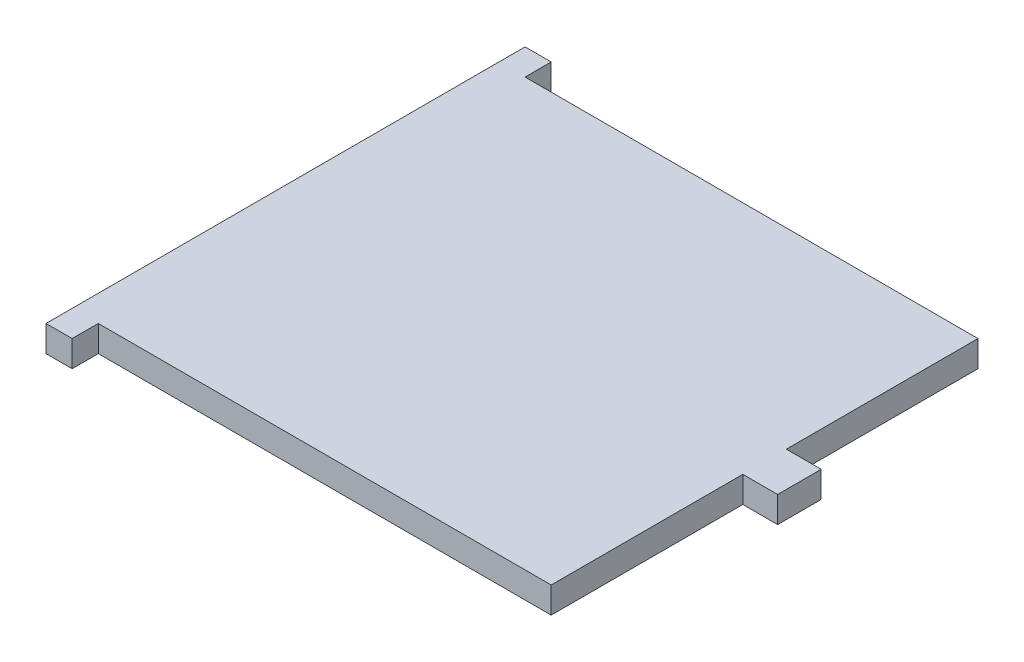
ISO-10303-21;
HEADER;
FILE_DESCRIPTION(('STEP AP214'),'2;1');
FILE_NAME('part.step','',(''),(''),'','','');
FILE_SCHEMA(('AUTOMOTIVE_DESIGN { 1 0 10303 214 1 1 1 1 }'));
ENDSEC;
DATA;
#1=APPLICATION_CONTEXT('core data for automotive mechanical design processes');
#2=APPLICATION_PROTOCOL_DEFINITION('international standard','automotive_design',2000,#1);
#3=PRODUCT_CONTEXT('',#1,'mechanical');
#4=PRODUCT('Part','Part','',(#3));
#5=PRODUCT_RELATED_PRODUCT_CATEGORY('part','',(#4));
#6=PRODUCT_DEFINITION_FORMATION('','',#4);
#7=PRODUCT_DEFINITION_CONTEXT('part definition',#1,'design');
#8=PRODUCT_DEFINITION('design','',#6,#7);
#9=PRODUCT_DEFINITION_SHAPE('','',#8);
#10=(LENGTH_UNIT() NAMED_UNIT(*) SI_UNIT(.MILLI.,.METRE.));
#11=(NAMED_UNIT(*) PLANE_ANGLE_UNIT() SI_UNIT($,.RADIAN.));
#12=(NAMED_UNIT(*) SI_UNIT($,.STERADIAN.) SOLID_ANGLE_UNIT());
#13=UNCERTAINTY_MEASURE_WITH_UNIT(LENGTH_MEASURE(1.E-05),#10,'distance_accuracy_value','');
#14=(GEOMETRIC_REPRESENTATION_CONTEXT(3) GLOBAL_UNCERTAINTY_ASSIGNED_CONTEXT((#13)) GLOBAL_UNIT_ASSIGNED_CONTEXT((#10,
#11,#12)) REPRESENTATION_CONTEXT('',''));
#15=CARTESIAN_POINT('',(0.,0.,0.));
#16=DIRECTION('',(0.,0.,1.));
#17=DIRECTION('',(1.,0.,0.));
#18=AXIS2_PLACEMENT_3D('',#15,#16,#17);
#19=CARTESIAN_POINT('',(0.,3.,24.5));
#20=DIRECTION('',(0.,0.,-1.));
#21=DIRECTION('',(-1.,0.,0.));
#22=AXIS2_PLACEMENT_3D('',#19,#20,#21);
#23=PLANE('',#22);
#24=DIRECTION('',(1.,0.,0.));
#25=VECTOR('',#24,1.);
#26=CARTESIAN_POINT('',(0.,0.,24.5));
#27=LINE('',#26,#25);
#28=CARTESIAN_POINT('',(-27.5,0.,24.5));
#29=VERTEX_POINT('',#28);
#30=CARTESIAN_POINT('',(24.5,0.,24.5));
#31=VERTEX_POINT('',#30);
#32=EDGE_CURVE('E159',#29,#31,#27,.T.);
#33=ORIENTED_EDGE('',*,*,#32,.T.);
#34=DIRECTION('',(0.,-1.,0.));
#35=VECTOR('',#34,1.);
#36=CARTESIAN_POINT('',(24.5,3.,24.5));
#37=LINE('',#36,#35);
#38=CARTESIAN_POINT('',(24.5,3.,24.5));
#39=VERTEX_POINT('',#38);
#40=EDGE_CURVE('E11',#39,#31,#37,.T.);
#41=ORIENTED_EDGE('',*,*,#40,.F.);
#42=DIRECTION('',(1.,0.,0.));
#43=VECTOR('',#42,1.);
#44=CARTESIAN_POINT('',(0.,3.,24.5));
#45=LINE('',#44,#43);
#46=CARTESIAN_POINT('',(-27.5,3.,24.5));
#47=VERTEX_POINT('',#46);
#48=EDGE_CURVE('E234',#47,#39,#45,.T.);
#49=ORIENTED_EDGE('',*,*,#48,.F.);
#50=DIRECTION('',(0.,-1.,0.));
#51=VECTOR('',#50,1.);
#52=CARTESIAN_POINT('',(-27.5,3.,24.5));
#53=LINE('',#52,#51);
#54=EDGE_CURVE('E53',#47,#29,#53,.T.);
#55=ORIENTED_EDGE('',*,*,#54,.T.);
#56=EDGE_LOOP('',(#33,#41,#49,#55));
#57=FACE_BOUND('',#56,.T.);
#58=ADVANCED_FACE('F37',(#57),#23,.F.);
#59=CARTESIAN_POINT('',(24.5,3.,0.));
#60=DIRECTION('',(-1.,0.,0.));
#61=DIRECTION('',(0.,0.,1.));
#62=AXIS2_PLACEMENT_3D('',#59,#60,#61);
#63=PLANE('',#62);
#64=DIRECTION('',(0.,0.,-1.));
#65=VECTOR('',#64,1.);
#66=CARTESIAN_POINT('',(24.5,0.,0.));
#67=LINE('',#66,#65);
#68=CARTESIAN_POINT('',(24.5,0.,2.5));
#69=VERTEX_POINT('',#68);
#70=EDGE_CURVE('E161',#31,#69,#67,.T.);
#71=ORIENTED_EDGE('',*,*,#70,.T.);
#72=DIRECTION('',(0.,-1.,0.));
#73=VECTOR('',#72,1.);
#74=CARTESIAN_POINT('',(24.5,3.,2.5));
#75=LINE('',#74,#73);
#76=CARTESIAN_POINT('',(24.5,3.,2.5));
#77=VERTEX_POINT('',#76);
#78=EDGE_CURVE('E45',#77,#69,#75,.T.);
#79=ORIENTED_EDGE('',*,*,#78,.F.);
#80=DIRECTION('',(0.,0.,-1.));
#81=VECTOR('',#80,1.);
#82=CARTESIAN_POINT('',(24.5,3.,0.));
#83=LINE('',#82,#81);
#84=EDGE_CURVE('E103',#39,#77,#83,.T.);
#85=ORIENTED_EDGE('',*,*,#84,.F.);
#86=ORIENTED_EDGE('',*,*,#40,.T.);
#87=EDGE_LOOP('',(#71,#79,#85,#86));
#88=FACE_BOUND('',#87,.T.);
#89=ADVANCED_FACE('F257',(#88),#63,.F.);
#90=CARTESIAN_POINT('',(0.,3.,2.49999999999998));
#91=DIRECTION('',(0.,0.,-1.));
#92=DIRECTION('',(-1.,0.,0.));
#93=AXIS2_PLACEMENT_3D('',#90,#91,#92);
#94=PLANE('',#93);
#95=DIRECTION('',(1.,0.,0.));
#96=VECTOR('',#95,1.);
#97=CARTESIAN_POINT('',(0.,0.,2.49999999999998));
#98=LINE('',#97,#96);
#99=CARTESIAN_POINT('',(28.5,0.,2.5));
#100=VERTEX_POINT('',#99);
#101=EDGE_CURVE('E163',#69,#100,#98,.T.);
#102=ORIENTED_EDGE('',*,*,#101,.T.);
#103=DIRECTION('',(0.,-1.,0.));
#104=VECTOR('',#103,1.);
#105=CARTESIAN_POINT('',(28.5,3.,2.5));
#106=LINE('',#105,#104);
#107=CARTESIAN_POINT('',(28.5,3.,2.5));
#108=VERTEX_POINT('',#107);
#109=EDGE_CURVE('E199',#108,#100,#106,.T.);
#110=ORIENTED_EDGE('',*,*,#109,.F.);
#111=DIRECTION('',(1.,0.,0.));
#112=VECTOR('',#111,1.);
#113=CARTESIAN_POINT('',(0.,3.,2.49999999999998));
#114=LINE('',#113,#112);
#115=EDGE_CURVE('E206',#77,#108,#114,.T.);
#116=ORIENTED_EDGE('',*,*,#115,.F.);
#117=ORIENTED_EDGE('',*,*,#78,.T.);
#118=EDGE_LOOP('',(#102,#110,#116,#117));
#119=FACE_BOUND('',#118,.T.);
#120=ADVANCED_FACE('F204',(#119),#94,.F.);
#121=CARTESIAN_POINT('',(28.5,3.,0.));
#122=DIRECTION('',(1.,0.,0.));
#123=DIRECTION('',(0.,0.,-1.));
#124=AXIS2_PLACEMENT_3D('',#121,#122,#123);
#125=PLANE('',#124);
#126=DIRECTION('',(0.,0.,1.));
#127=VECTOR('',#126,1.);
#128=CARTESIAN_POINT('',(28.5,0.,0.));
#129=LINE('',#128,#127);
#130=CARTESIAN_POINT('',(28.5,0.,-2.5));
#131=VERTEX_POINT('',#130);
#132=EDGE_CURVE('E167',#131,#100,#129,.T.);
#133=ORIENTED_EDGE('',*,*,#132,.F.);
#134=DIRECTION('',(0.,-1.,0.));
#135=VECTOR('',#134,1.);
#136=CARTESIAN_POINT('',(28.5,3.,-2.5));
#137=LINE('',#136,#135);
#138=CARTESIAN_POINT('',(28.5,3.,-2.5));
#139=VERTEX_POINT('',#138);
#140=EDGE_CURVE('E197',#139,#131,#137,.T.);
#141=ORIENTED_EDGE('',*,*,#140,.F.);
#142=DIRECTION('',(0.,0.,1.));
#143=VECTOR('',#142,1.);
#144=CARTESIAN_POINT('',(28.5,3.,0.));
#145=LINE('',#144,#143);
#146=EDGE_CURVE('E216',#139,#108,#145,.T.);
#147=ORIENTED_EDGE('',*,*,#146,.T.);
#148=ORIENTED_EDGE('',*,*,#109,.T.);
#149=EDGE_LOOP('',(#133,#141,#147,#148));
#150=FACE_BOUND('',#149,.T.);
#151=ADVANCED_FACE('F213',(#150),#125,.T.);
#152=CARTESIAN_POINT('',(0.,3.,-2.5));
#153=DIRECTION('',(0.,0.,-1.));
#154=DIRECTION('',(-1.,0.,0.));
#155=AXIS2_PLACEMENT_3D('',#152,#153,#154);
#156=PLANE('',#155);
#157=DIRECTION('',(1.,0.,0.));
#158=VECTOR('',#157,1.);
#159=CARTESIAN_POINT('',(0.,0.,-2.5));
#160=LINE('',#159,#158);
#161=CARTESIAN_POINT('',(24.5,0.,-2.5));
#162=VERTEX_POINT('',#161);
#163=EDGE_CURVE('E170',#162,#131,#160,.T.);
#164=ORIENTED_EDGE('',*,*,#163,.F.);
#165=DIRECTION('',(0.,-1.,0.));
#166=VECTOR('',#165,1.);
#167=CARTESIAN_POINT('',(24.5,3.,-2.5));
#168=LINE('',#167,#166);
#169=CARTESIAN_POINT('',(24.5,3.,-2.5));
#170=VERTEX_POINT('',#169);
#171=EDGE_CURVE('E195',#170,#162,#168,.T.);
#172=ORIENTED_EDGE('',*,*,#171,.F.);
#173=DIRECTION('',(1.,0.,0.));
#174=VECTOR('',#173,1.);
#175=CARTESIAN_POINT('',(0.,3.,-2.5));
#176=LINE('',#175,#174);
#177=EDGE_CURVE('E219',#170,#139,#176,.T.);
#178=ORIENTED_EDGE('',*,*,#177,.T.);
#179=ORIENTED_EDGE('',*,*,#140,.T.);
#180=EDGE_LOOP('',(#164,#172,#178,#179));
#181=FACE_BOUND('',#180,.T.);
#182=ADVANCED_FACE('F249',(#181),#156,.T.);
#183=CARTESIAN_POINT('',(24.5,0.,-24.5));
#184=VERTEX_POINT('',#183);
#185=EDGE_CURVE('E164',#162,#184,#67,.T.);
#186=ORIENTED_EDGE('',*,*,#185,.T.);
#187=DIRECTION('',(0.,-1.,0.));
#188=VECTOR('',#187,1.);
#189=CARTESIAN_POINT('',(24.5,3.,-24.5));
#190=LINE('',#189,#188);
#191=CARTESIAN_POINT('',(24.5,3.,-24.5));
#192=VERTEX_POINT('',#191);
#193=EDGE_CURVE('E193',#192,#184,#190,.T.);
#194=ORIENTED_EDGE('',*,*,#193,.F.);
#195=EDGE_CURVE('E221',#170,#192,#83,.T.);
#196=ORIENTED_EDGE('',*,*,#195,.F.);
#197=ORIENTED_EDGE('',*,*,#171,.T.);
#198=EDGE_LOOP('',(#186,#194,#196,#197));
#199=FACE_BOUND('',#198,.T.);
#200=ADVANCED_FACE('F242',(#199),#63,.F.);
#201=CARTESIAN_POINT('',(0.,3.,-24.5));
#202=DIRECTION('',(0.,0.,-1.));
#203=DIRECTION('',(-1.,0.,0.));
#204=AXIS2_PLACEMENT_3D('',#201,#202,#203);
#205=PLANE('',#204);
#206=DIRECTION('',(1.,0.,0.));
#207=VECTOR('',#206,1.);
#208=CARTESIAN_POINT('',(0.,0.,-24.5));
#209=LINE('',#208,#207);
#210=CARTESIAN_POINT('',(-27.5,0.,-24.5));
#211=VERTEX_POINT('',#210);
#212=EDGE_CURVE('E173',#211,#184,#209,.T.);
#213=ORIENTED_EDGE('',*,*,#212,.F.);
#214=DIRECTION('',(0.,-1.,0.));
#215=VECTOR('',#214,1.);
#216=CARTESIAN_POINT('',(-27.5,3.,-24.5));
#217=LINE('',#216,#215);
#218=CARTESIAN_POINT('',(-27.5,3.,-24.5));
#219=VERTEX_POINT('',#218);
#220=EDGE_CURVE('E191',#219,#211,#217,.T.);
#221=ORIENTED_EDGE('',*,*,#220,.F.);
#222=DIRECTION('',(1.,0.,0.));
#223=VECTOR('',#222,1.);
#224=CARTESIAN_POINT('',(0.,3.,-24.5));
#225=LINE('',#224,#223);
#226=EDGE_CURVE('E226',#219,#192,#225,.T.);
#227=ORIENTED_EDGE('',*,*,#226,.T.);
#228=ORIENTED_EDGE('',*,*,#193,.T.);
#229=EDGE_LOOP('',(#213,#221,#227,#228));
#230=FACE_BOUND('',#229,.T.);
#231=ADVANCED_FACE('F245',(#230),#205,.T.);
#232=CARTESIAN_POINT('',(-27.5,3.,0.));
#233=DIRECTION('',(1.,0.,0.));
#234=DIRECTION('',(0.,0.,-1.));
#235=AXIS2_PLACEMENT_3D('',#232,#233,#234);
#236=PLANE('',#235);
#237=DIRECTION('',(0.,0.,1.));
#238=VECTOR('',#237,1.);
#239=CARTESIAN_POINT('',(-27.5,0.,0.));
#240=LINE('',#239,#238);
#241=CARTESIAN_POINT('',(-27.5,0.,-27.5));
#242=VERTEX_POINT('',#241);
#243=EDGE_CURVE('E176',#242,#211,#240,.T.);
#244=ORIENTED_EDGE('',*,*,#243,.F.);
#245=DIRECTION('',(0.,-1.,0.));
#246=VECTOR('',#245,1.);
#247=CARTESIAN_POINT('',(-27.5,3.,-27.5));
#248=LINE('',#247,#246);
#249=CARTESIAN_POINT('',(-27.5,3.,-27.5));
#250=VERTEX_POINT('',#249);
#251=EDGE_CURVE('E189',#250,#242,#248,.T.);
#252=ORIENTED_EDGE('',*,*,#251,.F.);
#253=DIRECTION('',(0.,0.,1.));
#254=VECTOR('',#253,1.);
#255=CARTESIAN_POINT('',(-27.5,3.,0.));
#256=LINE('',#255,#254);
#257=EDGE_CURVE('E156',#250,#219,#256,.T.);
#258=ORIENTED_EDGE('',*,*,#257,.T.);
#259=ORIENTED_EDGE('',*,*,#220,.T.);
#260=EDGE_LOOP('',(#244,#252,#258,#259));
#261=FACE_BOUND('',#260,.T.);
#262=ADVANCED_FACE('F247',(#261),#236,.T.);
#263=CARTESIAN_POINT('',(0.,3.,-27.5));
#264=DIRECTION('',(0.,0.,-1.));
#265=DIRECTION('',(-1.,0.,0.));
#266=AXIS2_PLACEMENT_3D('',#263,#264,#265);
#267=PLANE('',#266);
#268=DIRECTION('',(1.,0.,0.));
#269=VECTOR('',#268,1.);
#270=CARTESIAN_POINT('',(0.,0.,-27.5));
#271=LINE('',#270,#269);
#272=CARTESIAN_POINT('',(-30.5,0.,-27.5));
#273=VERTEX_POINT('',#272);
#274=EDGE_CURVE('E179',#273,#242,#271,.T.);
#275=ORIENTED_EDGE('',*,*,#274,.F.);
#276=DIRECTION('',(0.,-1.,0.));
#277=VECTOR('',#276,1.);
#278=CARTESIAN_POINT('',(-30.5,3.,-27.5));
#279=LINE('',#278,#277);
#280=CARTESIAN_POINT('',(-30.5,3.,-27.5));
#281=VERTEX_POINT('',#280);
#282=EDGE_CURVE('E140',#281,#273,#279,.T.);
#283=ORIENTED_EDGE('',*,*,#282,.F.);
#284=DIRECTION('',(1.,0.,0.));
#285=VECTOR('',#284,1.);
#286=CARTESIAN_POINT('',(0.,3.,-27.5));
#287=LINE('',#286,#285);
#288=EDGE_CURVE('E150',#281,#250,#287,.T.);
#289=ORIENTED_EDGE('',*,*,#288,.T.);
#290=ORIENTED_EDGE('',*,*,#251,.T.);
#291=EDGE_LOOP('',(#275,#283,#289,#290));
#292=FACE_BOUND('',#291,.T.);
#293=ADVANCED_FACE('F231',(#292),#267,.T.);
#294=CARTESIAN_POINT('',(-30.5,3.,0.));
#295=DIRECTION('',(-1.,0.,0.));
#296=DIRECTION('',(0.,0.,1.));
#297=AXIS2_PLACEMENT_3D('',#294,#295,#296);
#298=PLANE('',#297);
#299=DIRECTION('',(0.,0.,-1.));
#300=VECTOR('',#299,1.);
#301=CARTESIAN_POINT('',(-30.5,0.,0.));
#302=LINE('',#301,#300);
#303=CARTESIAN_POINT('',(-30.5,0.,27.5));
#304=VERTEX_POINT('',#303);
#305=EDGE_CURVE('E136',#304,#273,#302,.T.);
#306=ORIENTED_EDGE('',*,*,#305,.F.);
#307=DIRECTION('',(0.,-1.,0.));
#308=VECTOR('',#307,1.);
#309=CARTESIAN_POINT('',(-30.5,3.,27.5));
#310=LINE('',#309,#308);
#311=CARTESIAN_POINT('',(-30.5,3.,27.5));
#312=VERTEX_POINT('',#311);
#313=EDGE_CURVE('E131',#312,#304,#310,.T.);
#314=ORIENTED_EDGE('',*,*,#313,.F.);
#315=DIRECTION('',(0.,0.,-1.));
#316=VECTOR('',#315,1.);
#317=CARTESIAN_POINT('',(-30.5,3.,0.));
#318=LINE('',#317,#316);
#319=EDGE_CURVE('E134',#312,#281,#318,.T.);
#320=ORIENTED_EDGE('',*,*,#319,.T.);
#321=ORIENTED_EDGE('',*,*,#282,.T.);
#322=EDGE_LOOP('',(#306,#314,#320,#321));
#323=FACE_BOUND('',#322,.T.);
#324=ADVANCED_FACE('F133',(#323),#298,.T.);
#325=CARTESIAN_POINT('',(0.,3.,27.5));
#326=DIRECTION('',(0.,0.,1.));
#327=DIRECTION('',(1.,0.,0.));
#328=AXIS2_PLACEMENT_3D('',#325,#326,#327);
#329=PLANE('',#328);
#330=DIRECTION('',(-1.,0.,0.));
#331=VECTOR('',#330,1.);
#332=CARTESIAN_POINT('',(0.,0.,27.5));
#333=LINE('',#332,#331);
#334=CARTESIAN_POINT('',(-27.5,0.,27.5));
#335=VERTEX_POINT('',#334);
#336=EDGE_CURVE('E184',#335,#304,#333,.T.);
#337=ORIENTED_EDGE('',*,*,#336,.F.);
#338=DIRECTION('',(0.,-1.,0.));
#339=VECTOR('',#338,1.);
#340=CARTESIAN_POINT('',(-27.5,3.,27.5));
#341=LINE('',#340,#339);
#342=CARTESIAN_POINT('',(-27.5,3.,27.5));
#343=VERTEX_POINT('',#342);
#344=EDGE_CURVE('E91',#343,#335,#341,.T.);
#345=ORIENTED_EDGE('',*,*,#344,.F.);
#346=DIRECTION('',(-1.,0.,0.));
#347=VECTOR('',#346,1.);
#348=CARTESIAN_POINT('',(0.,3.,27.5));
#349=LINE('',#348,#347);
#350=EDGE_CURVE('E147',#343,#312,#349,.T.);
#351=ORIENTED_EDGE('',*,*,#350,.T.);
#352=ORIENTED_EDGE('',*,*,#313,.T.);
#353=EDGE_LOOP('',(#337,#345,#351,#352));
#354=FACE_BOUND('',#353,.T.);
#355=ADVANCED_FACE('F152',(#354),#329,.T.);
#356=EDGE_CURVE('E180',#29,#335,#240,.T.);
#357=ORIENTED_EDGE('',*,*,#356,.F.);
#358=ORIENTED_EDGE('',*,*,#54,.F.);
#359=EDGE_CURVE('E153',#47,#343,#256,.T.);
#360=ORIENTED_EDGE('',*,*,#359,.T.);
#361=ORIENTED_EDGE('',*,*,#344,.T.);
#362=EDGE_LOOP('',(#357,#358,#360,#361));
#363=FACE_BOUND('',#362,.T.);
#364=ADVANCED_FACE('F263',(#363),#236,.T.);
#365=CARTESIAN_POINT('',(0.,3.,0.));
#366=DIRECTION('',(0.,1.,0.));
#367=DIRECTION('',(0.,0.,1.));
#368=AXIS2_PLACEMENT_3D('',#365,#366,#367);
#369=PLANE('',#368);
#370=ORIENTED_EDGE('',*,*,#48,.T.);
#371=ORIENTED_EDGE('',*,*,#84,.T.);
#372=ORIENTED_EDGE('',*,*,#115,.T.);
#373=ORIENTED_EDGE('',*,*,#146,.F.);
#374=ORIENTED_EDGE('',*,*,#177,.F.);
#375=ORIENTED_EDGE('',*,*,#195,.T.);
#376=ORIENTED_EDGE('',*,*,#226,.F.);
#377=ORIENTED_EDGE('',*,*,#257,.F.);
#378=ORIENTED_EDGE('',*,*,#288,.F.);
#379=ORIENTED_EDGE('',*,*,#319,.F.);
#380=ORIENTED_EDGE('',*,*,#350,.F.);
#381=ORIENTED_EDGE('',*,*,#359,.F.);
#382=EDGE_LOOP('',(#370,#371,#372,#373,#374,#375,#376,#377,#378,#379,#380,#381));
#383=FACE_BOUND('',#382,.T.);
#384=ADVANCED_FACE('F145',(#383),#369,.T.);
#385=CARTESIAN_POINT('',(0.,0.,0.));
#386=DIRECTION('',(0.,1.,0.));
#387=DIRECTION('',(0.,0.,1.));
#388=AXIS2_PLACEMENT_3D('',#385,#386,#387);
#389=PLANE('',#388);
#390=ORIENTED_EDGE('',*,*,#32,.F.);
#391=ORIENTED_EDGE('',*,*,#356,.T.);
#392=ORIENTED_EDGE('',*,*,#336,.T.);
#393=ORIENTED_EDGE('',*,*,#305,.T.);
#394=ORIENTED_EDGE('',*,*,#274,.T.);
#395=ORIENTED_EDGE('',*,*,#243,.T.);
#396=ORIENTED_EDGE('',*,*,#212,.T.);
#397=ORIENTED_EDGE('',*,*,#185,.F.);
#398=ORIENTED_EDGE('',*,*,#163,.T.);
#399=ORIENTED_EDGE('',*,*,#132,.T.);
#400=ORIENTED_EDGE('',*,*,#101,.F.);
#401=ORIENTED_EDGE('',*,*,#70,.F.);
#402=EDGE_LOOP('',(#390,#391,#392,#393,#394,#395,#396,#397,#398,#399,#400,#401));
#403=FACE_BOUND('',#402,.T.);
#404=ADVANCED_FACE('F208',(#403),#389,.F.);
#405=CLOSED_SHELL('',(#58,#89,#120,#151,#182,#200,#231,#262,#293,#324,#355,#364,#384,#404));
#406=MANIFOLD_SOLID_BREP('B2',#405);
#407=ADVANCED_BREP_SHAPE_REPRESENTATION('',(#18,#406),#14);
#408=SHAPE_DEFINITION_REPRESENTATION(#9,#407);
ENDSEC;
END-ISO-10303-21;
